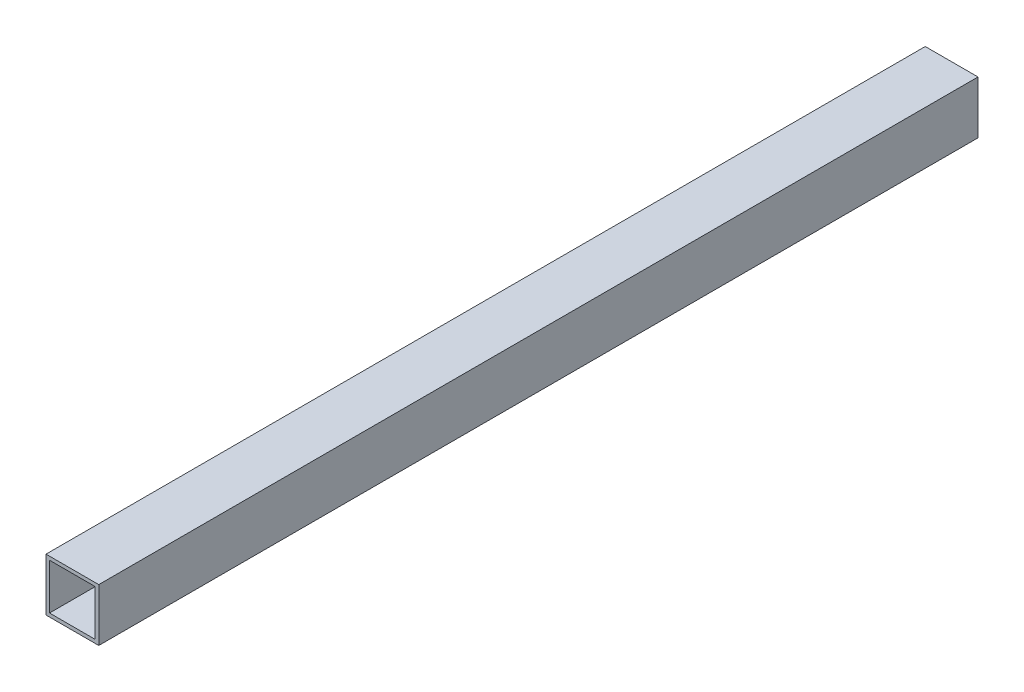
ISO-10303-21;
HEADER;
FILE_DESCRIPTION(('STEP AP214'),'2;1');
FILE_NAME('part.step','',(''),(''),'','','');
FILE_SCHEMA(('AUTOMOTIVE_DESIGN { 1 0 10303 214 1 1 1 1 }'));
ENDSEC;
DATA;
#1=APPLICATION_CONTEXT('core data for automotive mechanical design processes');
#2=APPLICATION_PROTOCOL_DEFINITION('international standard','automotive_design',2000,#1);
#3=PRODUCT_CONTEXT('',#1,'mechanical');
#4=PRODUCT('Part','Part','',(#3));
#5=PRODUCT_RELATED_PRODUCT_CATEGORY('part','',(#4));
#6=PRODUCT_DEFINITION_FORMATION('','',#4);
#7=PRODUCT_DEFINITION_CONTEXT('part definition',#1,'design');
#8=PRODUCT_DEFINITION('design','',#6,#7);
#9=PRODUCT_DEFINITION_SHAPE('','',#8);
#10=(LENGTH_UNIT() NAMED_UNIT(*) SI_UNIT(.MILLI.,.METRE.));
#11=(NAMED_UNIT(*) PLANE_ANGLE_UNIT() SI_UNIT($,.RADIAN.));
#12=(NAMED_UNIT(*) SI_UNIT($,.STERADIAN.) SOLID_ANGLE_UNIT());
#13=UNCERTAINTY_MEASURE_WITH_UNIT(LENGTH_MEASURE(1.E-05),#10,'distance_accuracy_value','');
#14=(GEOMETRIC_REPRESENTATION_CONTEXT(3) GLOBAL_UNCERTAINTY_ASSIGNED_CONTEXT((#13)) GLOBAL_UNIT_ASSIGNED_CONTEXT((#10,
#11,#12)) REPRESENTATION_CONTEXT('',''));
#15=CARTESIAN_POINT('',(0.,0.,0.));
#16=DIRECTION('',(0.,0.,1.));
#17=DIRECTION('',(1.,0.,0.));
#18=AXIS2_PLACEMENT_3D('',#15,#16,#17);
#19=CARTESIAN_POINT('',(-30.,30.,0.));
#20=DIRECTION('',(-1.,0.,0.));
#21=DIRECTION('',(0.,0.,1.));
#22=AXIS2_PLACEMENT_3D('',#19,#20,#21);
#23=PLANE('',#22);
#24=DIRECTION('',(0.,0.,1.));
#25=VECTOR('',#24,1.);
#26=CARTESIAN_POINT('',(-30.,-30.,0.));
#27=LINE('',#26,#25);
#28=CARTESIAN_POINT('',(-30.,-30.,0.));
#29=VERTEX_POINT('',#28);
#30=CARTESIAN_POINT('',(-30.,-30.,1000.));
#31=VERTEX_POINT('',#30);
#32=EDGE_CURVE('E93',#29,#31,#27,.T.);
#33=ORIENTED_EDGE('',*,*,#32,.T.);
#34=DIRECTION('',(0.,-1.,0.));
#35=VECTOR('',#34,1.);
#36=CARTESIAN_POINT('',(-30.,30.,1000.));
#37=LINE('',#36,#35);
#38=CARTESIAN_POINT('',(-30.,30.,1000.));
#39=VERTEX_POINT('',#38);
#40=EDGE_CURVE('E115',#39,#31,#37,.T.);
#41=ORIENTED_EDGE('',*,*,#40,.F.);
#42=DIRECTION('',(0.,0.,1.));
#43=VECTOR('',#42,1.);
#44=CARTESIAN_POINT('',(-30.,30.,0.));
#45=LINE('',#44,#43);
#46=CARTESIAN_POINT('',(-30.,30.,0.));
#47=VERTEX_POINT('',#46);
#48=EDGE_CURVE('E96',#47,#39,#45,.T.);
#49=ORIENTED_EDGE('',*,*,#48,.F.);
#50=DIRECTION('',(0.,-1.,0.));
#51=VECTOR('',#50,1.);
#52=CARTESIAN_POINT('',(-30.,30.,0.));
#53=LINE('',#52,#51);
#54=EDGE_CURVE('E92',#47,#29,#53,.T.);
#55=ORIENTED_EDGE('',*,*,#54,.T.);
#56=EDGE_LOOP('',(#33,#41,#49,#55));
#57=FACE_BOUND('',#56,.T.);
#58=ADVANCED_FACE('F36',(#57),#23,.T.);
#59=CARTESIAN_POINT('',(-30.,-30.,0.));
#60=DIRECTION('',(0.,-1.,0.));
#61=DIRECTION('',(0.,0.,-1.));
#62=AXIS2_PLACEMENT_3D('',#59,#60,#61);
#63=PLANE('',#62);
#64=DIRECTION('',(0.,0.,1.));
#65=VECTOR('',#64,1.);
#66=CARTESIAN_POINT('',(30.,-30.,0.));
#67=LINE('',#66,#65);
#68=CARTESIAN_POINT('',(30.,-30.,0.));
#69=VERTEX_POINT('',#68);
#70=CARTESIAN_POINT('',(30.,-30.,1000.));
#71=VERTEX_POINT('',#70);
#72=EDGE_CURVE('E103',#69,#71,#67,.T.);
#73=ORIENTED_EDGE('',*,*,#72,.T.);
#74=DIRECTION('',(1.,0.,0.));
#75=VECTOR('',#74,1.);
#76=CARTESIAN_POINT('',(-30.,-30.,1000.));
#77=LINE('',#76,#75);
#78=EDGE_CURVE('E102',#31,#71,#77,.T.);
#79=ORIENTED_EDGE('',*,*,#78,.F.);
#80=ORIENTED_EDGE('',*,*,#32,.F.);
#81=DIRECTION('',(1.,0.,0.));
#82=VECTOR('',#81,1.);
#83=CARTESIAN_POINT('',(-30.,-30.,0.));
#84=LINE('',#83,#82);
#85=EDGE_CURVE('E85',#29,#69,#84,.T.);
#86=ORIENTED_EDGE('',*,*,#85,.T.);
#87=EDGE_LOOP('',(#73,#79,#80,#86));
#88=FACE_BOUND('',#87,.T.);
#89=ADVANCED_FACE('F100',(#88),#63,.T.);
#90=CARTESIAN_POINT('',(30.,30.,0.));
#91=DIRECTION('',(1.,0.,0.));
#92=DIRECTION('',(0.,0.,-1.));
#93=AXIS2_PLACEMENT_3D('',#90,#91,#92);
#94=PLANE('',#93);
#95=DIRECTION('',(0.,0.,1.));
#96=VECTOR('',#95,1.);
#97=CARTESIAN_POINT('',(30.,30.,0.));
#98=LINE('',#97,#96);
#99=CARTESIAN_POINT('',(30.,30.,0.));
#100=VERTEX_POINT('',#99);
#101=CARTESIAN_POINT('',(30.,30.,1000.));
#102=VERTEX_POINT('',#101);
#103=EDGE_CURVE('E40',#100,#102,#98,.T.);
#104=ORIENTED_EDGE('',*,*,#103,.T.);
#105=DIRECTION('',(0.,1.,0.));
#106=VECTOR('',#105,1.);
#107=CARTESIAN_POINT('',(30.,30.,1000.));
#108=LINE('',#107,#106);
#109=EDGE_CURVE('E112',#71,#102,#108,.T.);
#110=ORIENTED_EDGE('',*,*,#109,.F.);
#111=ORIENTED_EDGE('',*,*,#72,.F.);
#112=DIRECTION('',(0.,1.,0.));
#113=VECTOR('',#112,1.);
#114=CARTESIAN_POINT('',(30.,30.,0.));
#115=LINE('',#114,#113);
#116=EDGE_CURVE('E107',#69,#100,#115,.T.);
#117=ORIENTED_EDGE('',*,*,#116,.T.);
#118=EDGE_LOOP('',(#104,#110,#111,#117));
#119=FACE_BOUND('',#118,.T.);
#120=ADVANCED_FACE('F121',(#119),#94,.T.);
#121=CARTESIAN_POINT('',(-30.,30.,0.));
#122=DIRECTION('',(0.,1.,0.));
#123=DIRECTION('',(0.,0.,1.));
#124=AXIS2_PLACEMENT_3D('',#121,#122,#123);
#125=PLANE('',#124);
#126=DIRECTION('',(-1.,0.,0.));
#127=VECTOR('',#126,1.);
#128=CARTESIAN_POINT('',(-30.,30.,1000.));
#129=LINE('',#128,#127);
#130=EDGE_CURVE('E126',#102,#39,#129,.T.);
#131=ORIENTED_EDGE('',*,*,#130,.F.);
#132=ORIENTED_EDGE('',*,*,#103,.F.);
#133=DIRECTION('',(-1.,0.,0.));
#134=VECTOR('',#133,1.);
#135=CARTESIAN_POINT('',(-30.,30.,0.));
#136=LINE('',#135,#134);
#137=EDGE_CURVE('E109',#100,#47,#136,.T.);
#138=ORIENTED_EDGE('',*,*,#137,.T.);
#139=ORIENTED_EDGE('',*,*,#48,.T.);
#140=EDGE_LOOP('',(#131,#132,#138,#139));
#141=FACE_BOUND('',#140,.T.);
#142=ADVANCED_FACE('F38',(#141),#125,.T.);
#143=CARTESIAN_POINT('',(0.,0.,0.));
#144=DIRECTION('',(0.,0.,1.));
#145=DIRECTION('',(1.,0.,0.));
#146=AXIS2_PLACEMENT_3D('',#143,#144,#145);
#147=PLANE('',#146);
#148=DIRECTION('',(0.,-1.,0.));
#149=VECTOR('',#148,1.);
#150=CARTESIAN_POINT('',(-26.,26.,0.));
#151=LINE('',#150,#149);
#152=CARTESIAN_POINT('',(-26.,-26.,0.));
#153=VERTEX_POINT('',#152);
#154=CARTESIAN_POINT('',(-26.,26.,0.));
#155=VERTEX_POINT('',#154);
#156=EDGE_CURVE('E131',#153,#155,#151,.F.);
#157=ORIENTED_EDGE('',*,*,#156,.F.);
#158=DIRECTION('',(1.,0.,0.));
#159=VECTOR('',#158,1.);
#160=CARTESIAN_POINT('',(-26.,-26.,0.));
#161=LINE('',#160,#159);
#162=CARTESIAN_POINT('',(26.,-26.,0.));
#163=VERTEX_POINT('',#162);
#164=EDGE_CURVE('E135',#163,#153,#161,.F.);
#165=ORIENTED_EDGE('',*,*,#164,.F.);
#166=DIRECTION('',(0.,1.,0.));
#167=VECTOR('',#166,1.);
#168=CARTESIAN_POINT('',(26.,26.,0.));
#169=LINE('',#168,#167);
#170=CARTESIAN_POINT('',(26.,26.,0.));
#171=VERTEX_POINT('',#170);
#172=EDGE_CURVE('E142',#171,#163,#169,.F.);
#173=ORIENTED_EDGE('',*,*,#172,.F.);
#174=DIRECTION('',(-1.,0.,0.));
#175=VECTOR('',#174,1.);
#176=CARTESIAN_POINT('',(-26.,26.,0.));
#177=LINE('',#176,#175);
#178=EDGE_CURVE('E127',#155,#171,#177,.F.);
#179=ORIENTED_EDGE('',*,*,#178,.F.);
#180=EDGE_LOOP('',(#157,#165,#173,#179));
#181=FACE_BOUND('',#180,.T.);
#182=ORIENTED_EDGE('',*,*,#54,.F.);
#183=ORIENTED_EDGE('',*,*,#137,.F.);
#184=ORIENTED_EDGE('',*,*,#116,.F.);
#185=ORIENTED_EDGE('',*,*,#85,.F.);
#186=EDGE_LOOP('',(#182,#183,#184,#185));
#187=FACE_BOUND('',#186,.T.);
#188=ADVANCED_FACE('F106',(#181,#187),#147,.F.);
#189=CARTESIAN_POINT('',(0.,0.,1000.));
#190=DIRECTION('',(0.,0.,1.));
#191=DIRECTION('',(1.,0.,0.));
#192=AXIS2_PLACEMENT_3D('',#189,#190,#191);
#193=PLANE('',#192);
#194=DIRECTION('',(0.,-1.,0.));
#195=VECTOR('',#194,1.);
#196=CARTESIAN_POINT('',(-26.,26.,1000.));
#197=LINE('',#196,#195);
#198=CARTESIAN_POINT('',(-26.,-26.,1000.));
#199=VERTEX_POINT('',#198);
#200=CARTESIAN_POINT('',(-26.,26.,1000.));
#201=VERTEX_POINT('',#200);
#202=EDGE_CURVE('E11',#199,#201,#197,.F.);
#203=ORIENTED_EDGE('',*,*,#202,.T.);
#204=DIRECTION('',(-1.,0.,0.));
#205=VECTOR('',#204,1.);
#206=CARTESIAN_POINT('',(-26.,26.,1000.));
#207=LINE('',#206,#205);
#208=CARTESIAN_POINT('',(26.,26.,1000.));
#209=VERTEX_POINT('',#208);
#210=EDGE_CURVE('E152',#201,#209,#207,.F.);
#211=ORIENTED_EDGE('',*,*,#210,.T.);
#212=DIRECTION('',(0.,1.,0.));
#213=VECTOR('',#212,1.);
#214=CARTESIAN_POINT('',(26.,26.,1000.));
#215=LINE('',#214,#213);
#216=CARTESIAN_POINT('',(26.,-26.,1000.));
#217=VERTEX_POINT('',#216);
#218=EDGE_CURVE('E145',#209,#217,#215,.F.);
#219=ORIENTED_EDGE('',*,*,#218,.T.);
#220=DIRECTION('',(1.,0.,0.));
#221=VECTOR('',#220,1.);
#222=CARTESIAN_POINT('',(-26.,-26.,1000.));
#223=LINE('',#222,#221);
#224=EDGE_CURVE('E54',#217,#199,#223,.F.);
#225=ORIENTED_EDGE('',*,*,#224,.T.);
#226=EDGE_LOOP('',(#203,#211,#219,#225));
#227=FACE_BOUND('',#226,.T.);
#228=ORIENTED_EDGE('',*,*,#40,.T.);
#229=ORIENTED_EDGE('',*,*,#78,.T.);
#230=ORIENTED_EDGE('',*,*,#109,.T.);
#231=ORIENTED_EDGE('',*,*,#130,.T.);
#232=EDGE_LOOP('',(#228,#229,#230,#231));
#233=FACE_BOUND('',#232,.T.);
#234=ADVANCED_FACE('F125',(#227,#233),#193,.T.);
#235=CARTESIAN_POINT('',(-26.,26.,0.));
#236=DIRECTION('',(0.,-1.,0.));
#237=DIRECTION('',(0.,0.,-1.));
#238=AXIS2_PLACEMENT_3D('',#235,#236,#237);
#239=PLANE('',#238);
#240=DIRECTION('',(0.,0.,1.));
#241=VECTOR('',#240,1.);
#242=CARTESIAN_POINT('',(26.,26.,0.));
#243=LINE('',#242,#241);
#244=EDGE_CURVE('E147',#171,#209,#243,.T.);
#245=ORIENTED_EDGE('',*,*,#244,.T.);
#246=ORIENTED_EDGE('',*,*,#210,.F.);
#247=DIRECTION('',(0.,0.,1.));
#248=VECTOR('',#247,1.);
#249=CARTESIAN_POINT('',(-26.,26.,0.));
#250=LINE('',#249,#248);
#251=EDGE_CURVE('E134',#155,#201,#250,.T.);
#252=ORIENTED_EDGE('',*,*,#251,.F.);
#253=ORIENTED_EDGE('',*,*,#178,.T.);
#254=EDGE_LOOP('',(#245,#246,#252,#253));
#255=FACE_BOUND('',#254,.T.);
#256=ADVANCED_FACE('F163',(#255),#239,.T.);
#257=CARTESIAN_POINT('',(26.,26.,0.));
#258=DIRECTION('',(-1.,0.,0.));
#259=DIRECTION('',(0.,0.,1.));
#260=AXIS2_PLACEMENT_3D('',#257,#258,#259);
#261=PLANE('',#260);
#262=DIRECTION('',(0.,0.,1.));
#263=VECTOR('',#262,1.);
#264=CARTESIAN_POINT('',(26.,-26.,0.));
#265=LINE('',#264,#263);
#266=EDGE_CURVE('E139',#163,#217,#265,.T.);
#267=ORIENTED_EDGE('',*,*,#266,.T.);
#268=ORIENTED_EDGE('',*,*,#218,.F.);
#269=ORIENTED_EDGE('',*,*,#244,.F.);
#270=ORIENTED_EDGE('',*,*,#172,.T.);
#271=EDGE_LOOP('',(#267,#268,#269,#270));
#272=FACE_BOUND('',#271,.T.);
#273=ADVANCED_FACE('F172',(#272),#261,.T.);
#274=CARTESIAN_POINT('',(-26.,-26.,0.));
#275=DIRECTION('',(0.,1.,0.));
#276=DIRECTION('',(0.,0.,1.));
#277=AXIS2_PLACEMENT_3D('',#274,#275,#276);
#278=PLANE('',#277);
#279=DIRECTION('',(0.,0.,1.));
#280=VECTOR('',#279,1.);
#281=CARTESIAN_POINT('',(-26.,-26.,0.));
#282=LINE('',#281,#280);
#283=EDGE_CURVE('E46',#153,#199,#282,.T.);
#284=ORIENTED_EDGE('',*,*,#283,.T.);
#285=ORIENTED_EDGE('',*,*,#224,.F.);
#286=ORIENTED_EDGE('',*,*,#266,.F.);
#287=ORIENTED_EDGE('',*,*,#164,.T.);
#288=EDGE_LOOP('',(#284,#285,#286,#287));
#289=FACE_BOUND('',#288,.T.);
#290=ADVANCED_FACE('F177',(#289),#278,.T.);
#291=CARTESIAN_POINT('',(-26.,26.,0.));
#292=DIRECTION('',(1.,0.,0.));
#293=DIRECTION('',(0.,0.,-1.));
#294=AXIS2_PLACEMENT_3D('',#291,#292,#293);
#295=PLANE('',#294);
#296=ORIENTED_EDGE('',*,*,#202,.F.);
#297=ORIENTED_EDGE('',*,*,#283,.F.);
#298=ORIENTED_EDGE('',*,*,#156,.T.);
#299=ORIENTED_EDGE('',*,*,#251,.T.);
#300=EDGE_LOOP('',(#296,#297,#298,#299));
#301=FACE_BOUND('',#300,.T.);
#302=ADVANCED_FACE('F181',(#301),#295,.T.);
#303=CLOSED_SHELL('',(#58,#89,#120,#142,#188,#234,#256,#273,#290,#302));
#304=MANIFOLD_SOLID_BREP('B2',#303);
#305=ADVANCED_BREP_SHAPE_REPRESENTATION('',(#18,#304),#14);
#306=SHAPE_DEFINITION_REPRESENTATION(#9,#305);
ENDSEC;
END-ISO-10303-21;
